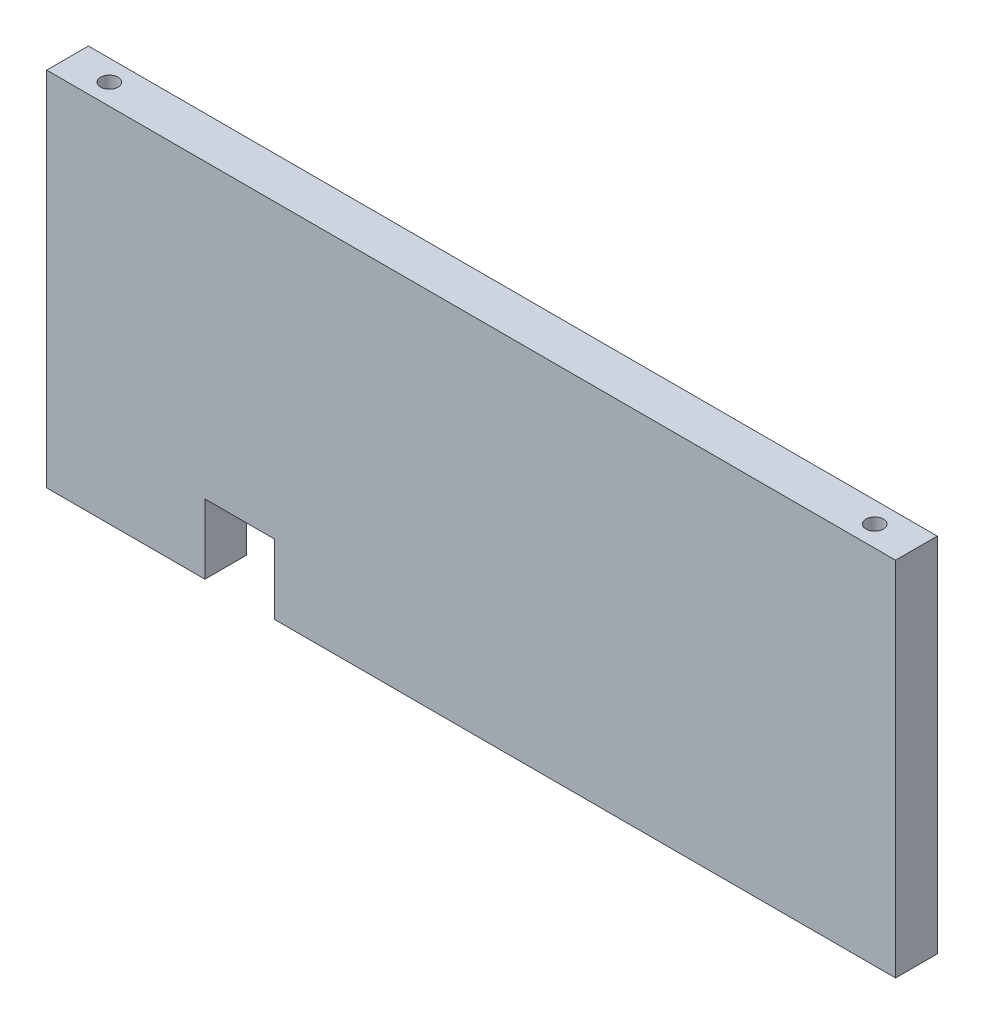
ISO-10303-21;
HEADER;
FILE_DESCRIPTION(('STEP AP214'),'2;1');
FILE_NAME('part.step','',(''),(''),'','','');
FILE_SCHEMA(('AUTOMOTIVE_DESIGN { 1 0 10303 214 1 1 1 1 }'));
ENDSEC;
DATA;
#1=APPLICATION_CONTEXT('core data for automotive mechanical design processes');
#2=APPLICATION_PROTOCOL_DEFINITION('international standard','automotive_design',2000,#1);
#3=PRODUCT_CONTEXT('',#1,'mechanical');
#4=PRODUCT('Part','Part','',(#3));
#5=PRODUCT_RELATED_PRODUCT_CATEGORY('part','',(#4));
#6=PRODUCT_DEFINITION_FORMATION('','',#4);
#7=PRODUCT_DEFINITION_CONTEXT('part definition',#1,'design');
#8=PRODUCT_DEFINITION('design','',#6,#7);
#9=PRODUCT_DEFINITION_SHAPE('','',#8);
#10=(LENGTH_UNIT() NAMED_UNIT(*) SI_UNIT(.MILLI.,.METRE.));
#11=(NAMED_UNIT(*) PLANE_ANGLE_UNIT() SI_UNIT($,.RADIAN.));
#12=(NAMED_UNIT(*) SI_UNIT($,.STERADIAN.) SOLID_ANGLE_UNIT());
#13=UNCERTAINTY_MEASURE_WITH_UNIT(LENGTH_MEASURE(1.E-05),#10,'distance_accuracy_value','');
#14=(GEOMETRIC_REPRESENTATION_CONTEXT(3) GLOBAL_UNCERTAINTY_ASSIGNED_CONTEXT((#13)) GLOBAL_UNIT_ASSIGNED_CONTEXT((#10,
#11,#12)) REPRESENTATION_CONTEXT('',''));
#15=CARTESIAN_POINT('',(0.,0.,0.));
#16=DIRECTION('',(0.,0.,1.));
#17=DIRECTION('',(1.,0.,0.));
#18=AXIS2_PLACEMENT_3D('',#15,#16,#17);
#19=CARTESIAN_POINT('',(66.222602739726,-24.111301369863,-6.));
#20=DIRECTION('',(0.,-1.,0.));
#21=DIRECTION('',(1.,0.,0.));
#22=AXIS2_PLACEMENT_3D('',#19,#20,#21);
#23=PLANE('',#22);
#24=DIRECTION('',(0.,0.,-1.));
#25=VECTOR('',#24,1.);
#26=CARTESIAN_POINT('',(-23.0366000109568,-24.111301369863,4.));
#27=LINE('',#26,#25);
#28=CARTESIAN_POINT('',(-23.0366000109568,-24.111301369863,0.));
#29=VERTEX_POINT('',#28);
#30=CARTESIAN_POINT('',(-23.0366000109568,-24.111301369863,-6.));
#31=VERTEX_POINT('',#30);
#32=EDGE_CURVE('E164',#29,#31,#27,.T.);
#33=ORIENTED_EDGE('',*,*,#32,.T.);
#34=DIRECTION('',(1.,0.,0.));
#35=VECTOR('',#34,1.);
#36=CARTESIAN_POINT('',(66.222602739726,-24.111301369863,-6.));
#37=LINE('',#36,#35);
#38=CARTESIAN_POINT('',(66.222602739726,-24.111301369863,-6.));
#39=VERTEX_POINT('',#38);
#40=EDGE_CURVE('E125',#31,#39,#37,.T.);
#41=ORIENTED_EDGE('',*,*,#40,.T.);
#42=DIRECTION('',(0.,0.,1.));
#43=VECTOR('',#42,1.);
#44=CARTESIAN_POINT('',(66.222602739726,-24.111301369863,-6.));
#45=LINE('',#44,#43);
#46=CARTESIAN_POINT('',(66.222602739726,-24.111301369863,0.));
#47=VERTEX_POINT('',#46);
#48=EDGE_CURVE('E151',#39,#47,#45,.T.);
#49=ORIENTED_EDGE('',*,*,#48,.T.);
#50=DIRECTION('',(1.,0.,0.));
#51=VECTOR('',#50,1.);
#52=CARTESIAN_POINT('',(66.222602739726,-24.111301369863,0.));
#53=LINE('',#52,#51);
#54=EDGE_CURVE('E138',#29,#47,#53,.T.);
#55=ORIENTED_EDGE('',*,*,#54,.F.);
#56=EDGE_LOOP('',(#33,#41,#49,#55));
#57=FACE_BOUND('',#56,.T.);
#58=CARTESIAN_POINT('',(60.222602739726,-24.111301369863,-3.));
#59=DIRECTION('',(0.,1.,0.));
#60=DIRECTION('',(0.,0.,1.));
#61=AXIS2_PLACEMENT_3D('',#58,#59,#60);
#62=CIRCLE('',#61,1.25);
#63=CARTESIAN_POINT('',(60.222602739726,-24.111301369863,-1.75));
#64=VERTEX_POINT('',#63);
#65=EDGE_CURVE('E177',#64,#64,#62,.T.);
#66=ORIENTED_EDGE('',*,*,#65,.T.);
#67=EDGE_LOOP('',(#66));
#68=FACE_BOUND('',#67,.T.);
#69=ADVANCED_FACE('F33',(#57,#68),#23,.T.);
#70=CARTESIAN_POINT('',(-55.777397260274,-24.111301369863,-6.));
#71=DIRECTION('',(-1.,0.,0.));
#72=DIRECTION('',(0.,0.,1.));
#73=AXIS2_PLACEMENT_3D('',#70,#71,#72);
#74=PLANE('',#73);
#75=DIRECTION('',(0.,-1.,0.));
#76=VECTOR('',#75,1.);
#77=CARTESIAN_POINT('',(-55.777397260274,-24.111301369863,0.));
#78=LINE('',#77,#76);
#79=CARTESIAN_POINT('',(-55.777397260274,27.888698630137,0.));
#80=VERTEX_POINT('',#79);
#81=CARTESIAN_POINT('',(-55.777397260274,-24.111301369863,0.));
#82=VERTEX_POINT('',#81);
#83=EDGE_CURVE('E135',#80,#82,#78,.T.);
#84=ORIENTED_EDGE('',*,*,#83,.F.);
#85=DIRECTION('',(0.,0.,1.));
#86=VECTOR('',#85,1.);
#87=CARTESIAN_POINT('',(-55.777397260274,27.888698630137,-6.));
#88=LINE('',#87,#86);
#89=CARTESIAN_POINT('',(-55.777397260274,27.888698630137,-6.));
#90=VERTEX_POINT('',#89);
#91=EDGE_CURVE('E57',#90,#80,#88,.T.);
#92=ORIENTED_EDGE('',*,*,#91,.F.);
#93=DIRECTION('',(0.,-1.,0.));
#94=VECTOR('',#93,1.);
#95=CARTESIAN_POINT('',(-55.777397260274,-24.111301369863,-6.));
#96=LINE('',#95,#94);
#97=CARTESIAN_POINT('',(-55.777397260274,-24.111301369863,-6.));
#98=VERTEX_POINT('',#97);
#99=EDGE_CURVE('E130',#90,#98,#96,.T.);
#100=ORIENTED_EDGE('',*,*,#99,.T.);
#101=DIRECTION('',(0.,0.,1.));
#102=VECTOR('',#101,1.);
#103=CARTESIAN_POINT('',(-55.777397260274,-24.111301369863,-6.));
#104=LINE('',#103,#102);
#105=EDGE_CURVE('E83',#98,#82,#104,.T.);
#106=ORIENTED_EDGE('',*,*,#105,.T.);
#107=EDGE_LOOP('',(#84,#92,#100,#106));
#108=FACE_BOUND('',#107,.T.);
#109=ADVANCED_FACE('F35',(#108),#74,.T.);
#110=CARTESIAN_POINT('',(-55.777397260274,27.888698630137,-6.));
#111=DIRECTION('',(0.,1.,0.));
#112=DIRECTION('',(0.,0.,1.));
#113=AXIS2_PLACEMENT_3D('',#110,#111,#112);
#114=PLANE('',#113);
#115=CARTESIAN_POINT('',(-49.777397260274,27.888698630137,-3.));
#116=DIRECTION('',(0.,1.,0.));
#117=DIRECTION('',(0.,0.,1.));
#118=AXIS2_PLACEMENT_3D('',#115,#116,#117);
#119=CIRCLE('',#118,1.25);
#120=CARTESIAN_POINT('',(-49.777397260274,27.888698630137,-1.75));
#121=VERTEX_POINT('',#120);
#122=EDGE_CURVE('E174',#121,#121,#119,.T.);
#123=ORIENTED_EDGE('',*,*,#122,.F.);
#124=EDGE_LOOP('',(#123));
#125=FACE_BOUND('',#124,.T.);
#126=CARTESIAN_POINT('',(60.222602739726,27.888698630137,-3.));
#127=DIRECTION('',(0.,1.,0.));
#128=DIRECTION('',(0.,0.,1.));
#129=AXIS2_PLACEMENT_3D('',#126,#127,#128);
#130=CIRCLE('',#129,1.25);
#131=CARTESIAN_POINT('',(60.222602739726,27.888698630137,-1.75));
#132=VERTEX_POINT('',#131);
#133=EDGE_CURVE('E167',#132,#132,#130,.T.);
#134=ORIENTED_EDGE('',*,*,#133,.F.);
#135=EDGE_LOOP('',(#134));
#136=FACE_BOUND('',#135,.T.);
#137=DIRECTION('',(-1.,0.,0.));
#138=VECTOR('',#137,1.);
#139=CARTESIAN_POINT('',(-55.777397260274,27.888698630137,0.));
#140=LINE('',#139,#138);
#141=CARTESIAN_POINT('',(66.222602739726,27.888698630137,0.));
#142=VERTEX_POINT('',#141);
#143=EDGE_CURVE('E145',#142,#80,#140,.T.);
#144=ORIENTED_EDGE('',*,*,#143,.F.);
#145=DIRECTION('',(0.,0.,1.));
#146=VECTOR('',#145,1.);
#147=CARTESIAN_POINT('',(66.222602739726,27.888698630137,-6.));
#148=LINE('',#147,#146);
#149=CARTESIAN_POINT('',(66.222602739726,27.888698630137,-6.));
#150=VERTEX_POINT('',#149);
#151=EDGE_CURVE('E149',#150,#142,#148,.T.);
#152=ORIENTED_EDGE('',*,*,#151,.F.);
#153=DIRECTION('',(-1.,0.,0.));
#154=VECTOR('',#153,1.);
#155=CARTESIAN_POINT('',(-55.777397260274,27.888698630137,-6.));
#156=LINE('',#155,#154);
#157=EDGE_CURVE('E128',#150,#90,#156,.T.);
#158=ORIENTED_EDGE('',*,*,#157,.T.);
#159=ORIENTED_EDGE('',*,*,#91,.T.);
#160=EDGE_LOOP('',(#144,#152,#158,#159));
#161=FACE_BOUND('',#160,.T.);
#162=ADVANCED_FACE('F184',(#125,#136,#161),#114,.T.);
#163=CARTESIAN_POINT('',(66.222602739726,27.888698630137,-6.));
#164=DIRECTION('',(1.,0.,0.));
#165=DIRECTION('',(0.,1.,0.));
#166=AXIS2_PLACEMENT_3D('',#163,#164,#165);
#167=PLANE('',#166);
#168=DIRECTION('',(0.,1.,0.));
#169=VECTOR('',#168,1.);
#170=CARTESIAN_POINT('',(66.222602739726,27.888698630137,0.));
#171=LINE('',#170,#169);
#172=EDGE_CURVE('E142',#47,#142,#171,.T.);
#173=ORIENTED_EDGE('',*,*,#172,.F.);
#174=ORIENTED_EDGE('',*,*,#48,.F.);
#175=DIRECTION('',(0.,1.,0.));
#176=VECTOR('',#175,1.);
#177=CARTESIAN_POINT('',(66.222602739726,27.888698630137,-6.));
#178=LINE('',#177,#176);
#179=EDGE_CURVE('E124',#39,#150,#178,.T.);
#180=ORIENTED_EDGE('',*,*,#179,.T.);
#181=ORIENTED_EDGE('',*,*,#151,.T.);
#182=EDGE_LOOP('',(#173,#174,#180,#181));
#183=FACE_BOUND('',#182,.T.);
#184=ADVANCED_FACE('F186',(#183),#167,.T.);
#185=DIRECTION('',(0.,0.,-1.));
#186=VECTOR('',#185,1.);
#187=CARTESIAN_POINT('',(-33.0366000109568,-24.111301369863,4.));
#188=LINE('',#187,#186);
#189=CARTESIAN_POINT('',(-33.0366000109568,-24.111301369863,0.));
#190=VERTEX_POINT('',#189);
#191=CARTESIAN_POINT('',(-33.0366000109568,-24.111301369863,-6.));
#192=VERTEX_POINT('',#191);
#193=EDGE_CURVE('E105',#190,#192,#188,.T.);
#194=ORIENTED_EDGE('',*,*,#193,.F.);
#195=EDGE_CURVE('E140',#82,#190,#53,.T.);
#196=ORIENTED_EDGE('',*,*,#195,.F.);
#197=ORIENTED_EDGE('',*,*,#105,.F.);
#198=EDGE_CURVE('E118',#98,#192,#37,.T.);
#199=ORIENTED_EDGE('',*,*,#198,.T.);
#200=EDGE_LOOP('',(#194,#196,#197,#199));
#201=FACE_BOUND('',#200,.T.);
#202=CARTESIAN_POINT('',(-49.777397260274,-24.111301369863,-3.));
#203=DIRECTION('',(0.,1.,0.));
#204=DIRECTION('',(0.,0.,1.));
#205=AXIS2_PLACEMENT_3D('',#202,#203,#204);
#206=CIRCLE('',#205,1.25);
#207=CARTESIAN_POINT('',(-49.777397260274,-24.111301369863,-1.75));
#208=VERTEX_POINT('',#207);
#209=EDGE_CURVE('E139',#208,#208,#206,.T.);
#210=ORIENTED_EDGE('',*,*,#209,.T.);
#211=EDGE_LOOP('',(#210));
#212=FACE_BOUND('',#211,.T.);
#213=ADVANCED_FACE('F122',(#201,#212),#23,.T.);
#214=CARTESIAN_POINT('',(0.,0.,-6.));
#215=DIRECTION('',(0.,0.,-1.));
#216=DIRECTION('',(-1.,0.,0.));
#217=AXIS2_PLACEMENT_3D('',#214,#215,#216);
#218=PLANE('',#217);
#219=DIRECTION('',(0.,-1.,0.));
#220=VECTOR('',#219,1.);
#221=CARTESIAN_POINT('',(-23.0366000109568,-24.111301369863,-6.));
#222=LINE('',#221,#220);
#223=CARTESIAN_POINT('',(-23.0366000109568,-14.111301369863,-6.));
#224=VERTEX_POINT('',#223);
#225=EDGE_CURVE('E113',#224,#31,#222,.T.);
#226=ORIENTED_EDGE('',*,*,#225,.F.);
#227=DIRECTION('',(1.,0.,0.));
#228=VECTOR('',#227,1.);
#229=CARTESIAN_POINT('',(-23.0366000109568,-14.111301369863,-6.));
#230=LINE('',#229,#228);
#231=CARTESIAN_POINT('',(-33.0366000109568,-14.111301369863,-6.));
#232=VERTEX_POINT('',#231);
#233=EDGE_CURVE('E120',#232,#224,#230,.T.);
#234=ORIENTED_EDGE('',*,*,#233,.F.);
#235=DIRECTION('',(0.,1.,0.));
#236=VECTOR('',#235,1.);
#237=CARTESIAN_POINT('',(-33.0366000109568,-14.111301369863,-6.));
#238=LINE('',#237,#236);
#239=EDGE_CURVE('E108',#192,#232,#238,.T.);
#240=ORIENTED_EDGE('',*,*,#239,.F.);
#241=ORIENTED_EDGE('',*,*,#198,.F.);
#242=ORIENTED_EDGE('',*,*,#99,.F.);
#243=ORIENTED_EDGE('',*,*,#157,.F.);
#244=ORIENTED_EDGE('',*,*,#179,.F.);
#245=ORIENTED_EDGE('',*,*,#40,.F.);
#246=EDGE_LOOP('',(#226,#234,#240,#241,#242,#243,#244,#245));
#247=FACE_BOUND('',#246,.T.);
#248=ADVANCED_FACE('F117',(#247),#218,.T.);
#249=CARTESIAN_POINT('',(0.,0.,0.));
#250=DIRECTION('',(0.,0.,-1.));
#251=DIRECTION('',(-1.,0.,0.));
#252=AXIS2_PLACEMENT_3D('',#249,#250,#251);
#253=PLANE('',#252);
#254=DIRECTION('',(1.,0.,0.));
#255=VECTOR('',#254,1.);
#256=CARTESIAN_POINT('',(0.,-14.111301369863,0.));
#257=LINE('',#256,#255);
#258=CARTESIAN_POINT('',(-33.0366000109568,-14.111301369863,0.));
#259=VERTEX_POINT('',#258);
#260=CARTESIAN_POINT('',(-23.0366000109568,-14.111301369863,0.));
#261=VERTEX_POINT('',#260);
#262=EDGE_CURVE('E41',#259,#261,#257,.T.);
#263=ORIENTED_EDGE('',*,*,#262,.T.);
#264=DIRECTION('',(0.,-1.,0.));
#265=VECTOR('',#264,1.);
#266=CARTESIAN_POINT('',(-23.0366000109568,0.,0.));
#267=LINE('',#266,#265);
#268=EDGE_CURVE('E11',#261,#29,#267,.T.);
#269=ORIENTED_EDGE('',*,*,#268,.T.);
#270=ORIENTED_EDGE('',*,*,#54,.T.);
#271=ORIENTED_EDGE('',*,*,#172,.T.);
#272=ORIENTED_EDGE('',*,*,#143,.T.);
#273=ORIENTED_EDGE('',*,*,#83,.T.);
#274=ORIENTED_EDGE('',*,*,#195,.T.);
#275=DIRECTION('',(0.,1.,0.));
#276=VECTOR('',#275,1.);
#277=CARTESIAN_POINT('',(-33.0366000109568,0.,0.));
#278=LINE('',#277,#276);
#279=EDGE_CURVE('E111',#190,#259,#278,.T.);
#280=ORIENTED_EDGE('',*,*,#279,.T.);
#281=EDGE_LOOP('',(#263,#269,#270,#271,#272,#273,#274,#280));
#282=FACE_BOUND('',#281,.T.);
#283=ADVANCED_FACE('F157',(#282),#253,.F.);
#284=CARTESIAN_POINT('',(60.222602739726,-24.111301369863,-3.));
#285=DIRECTION('',(0.,1.,0.));
#286=DIRECTION('',(0.,0.,1.));
#287=AXIS2_PLACEMENT_3D('',#284,#285,#286);
#288=CYLINDRICAL_SURFACE('',#287,1.25);
#289=ORIENTED_EDGE('',*,*,#65,.F.);
#290=EDGE_LOOP('',(#289));
#291=FACE_BOUND('',#290,.T.);
#292=ORIENTED_EDGE('',*,*,#133,.T.);
#293=EDGE_LOOP('',(#292));
#294=FACE_BOUND('',#293,.T.);
#295=ADVANCED_FACE('F182',(#291,#294),#288,.F.);
#296=CARTESIAN_POINT('',(-49.777397260274,-24.111301369863,-3.));
#297=DIRECTION('',(0.,1.,0.));
#298=DIRECTION('',(0.,0.,1.));
#299=AXIS2_PLACEMENT_3D('',#296,#297,#298);
#300=CYLINDRICAL_SURFACE('',#299,1.25);
#301=ORIENTED_EDGE('',*,*,#209,.F.);
#302=EDGE_LOOP('',(#301));
#303=FACE_BOUND('',#302,.T.);
#304=ORIENTED_EDGE('',*,*,#122,.T.);
#305=EDGE_LOOP('',(#304));
#306=FACE_BOUND('',#305,.T.);
#307=ADVANCED_FACE('F219',(#303,#306),#300,.F.);
#308=CARTESIAN_POINT('',(-23.0366000109568,-24.111301369863,4.));
#309=DIRECTION('',(1.,0.,0.));
#310=DIRECTION('',(0.,0.,-1.));
#311=AXIS2_PLACEMENT_3D('',#308,#309,#310);
#312=PLANE('',#311);
#313=DIRECTION('',(0.,0.,-1.));
#314=VECTOR('',#313,1.);
#315=CARTESIAN_POINT('',(-23.0366000109568,-14.111301369863,4.));
#316=LINE('',#315,#314);
#317=EDGE_CURVE('E162',#261,#224,#316,.T.);
#318=ORIENTED_EDGE('',*,*,#317,.T.);
#319=ORIENTED_EDGE('',*,*,#225,.T.);
#320=ORIENTED_EDGE('',*,*,#32,.F.);
#321=ORIENTED_EDGE('',*,*,#268,.F.);
#322=EDGE_LOOP('',(#318,#319,#320,#321));
#323=FACE_BOUND('',#322,.T.);
#324=ADVANCED_FACE('F223',(#323),#312,.F.);
#325=CARTESIAN_POINT('',(-23.0366000109568,-14.111301369863,4.));
#326=DIRECTION('',(0.,1.,0.));
#327=DIRECTION('',(0.,0.,1.));
#328=AXIS2_PLACEMENT_3D('',#325,#326,#327);
#329=PLANE('',#328);
#330=DIRECTION('',(0.,0.,-1.));
#331=VECTOR('',#330,1.);
#332=CARTESIAN_POINT('',(-33.0366000109568,-14.111301369863,4.));
#333=LINE('',#332,#331);
#334=EDGE_CURVE('E48',#259,#232,#333,.T.);
#335=ORIENTED_EDGE('',*,*,#334,.T.);
#336=ORIENTED_EDGE('',*,*,#233,.T.);
#337=ORIENTED_EDGE('',*,*,#317,.F.);
#338=ORIENTED_EDGE('',*,*,#262,.F.);
#339=EDGE_LOOP('',(#335,#336,#337,#338));
#340=FACE_BOUND('',#339,.T.);
#341=ADVANCED_FACE('F161',(#340),#329,.F.);
#342=CARTESIAN_POINT('',(-33.0366000109568,-14.111301369863,4.));
#343=DIRECTION('',(-1.,0.,0.));
#344=DIRECTION('',(0.,0.,1.));
#345=AXIS2_PLACEMENT_3D('',#342,#343,#344);
#346=PLANE('',#345);
#347=ORIENTED_EDGE('',*,*,#193,.T.);
#348=ORIENTED_EDGE('',*,*,#239,.T.);
#349=ORIENTED_EDGE('',*,*,#334,.F.);
#350=ORIENTED_EDGE('',*,*,#279,.F.);
#351=EDGE_LOOP('',(#347,#348,#349,#350));
#352=FACE_BOUND('',#351,.T.);
#353=ADVANCED_FACE('F107',(#352),#346,.F.);
#354=CLOSED_SHELL('',(#69,#109,#162,#184,#213,#248,#283,#295,#307,#324,#341,#353));
#355=MANIFOLD_SOLID_BREP('B2',#354);
#356=ADVANCED_BREP_SHAPE_REPRESENTATION('',(#18,#355),#14);
#357=SHAPE_DEFINITION_REPRESENTATION(#9,#356);
ENDSEC;
END-ISO-10303-21;
